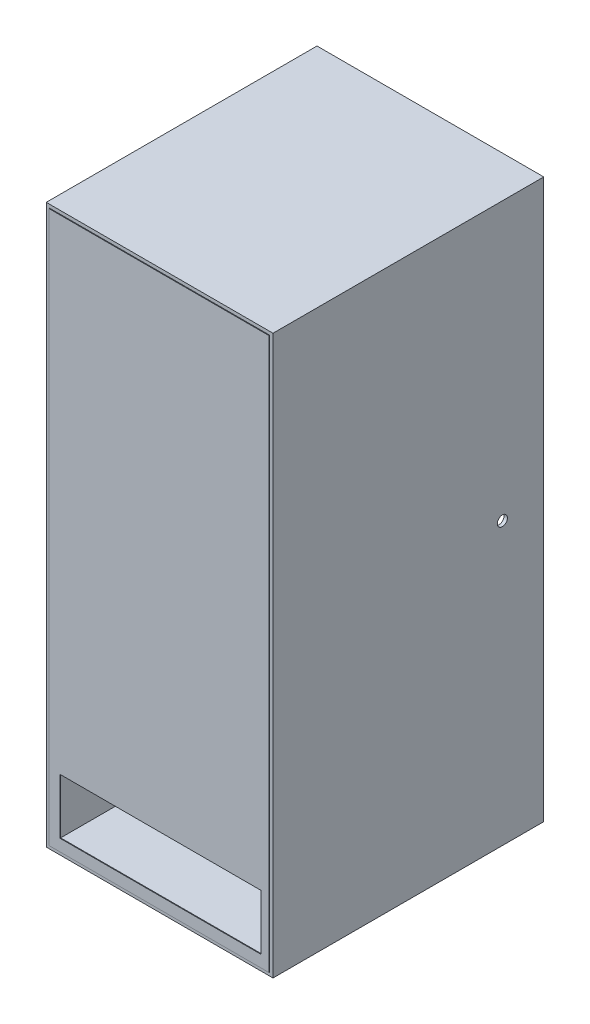
ISO-10303-21;
HEADER;
FILE_DESCRIPTION(('STEP AP214'),'2;1');
FILE_NAME('part.step','',(''),(''),'','','');
FILE_SCHEMA(('AUTOMOTIVE_DESIGN { 1 0 10303 214 1 1 1 1 }'));
ENDSEC;
DATA;
#1=APPLICATION_CONTEXT('core data for automotive mechanical design processes');
#2=APPLICATION_PROTOCOL_DEFINITION('international standard','automotive_design',2000,#1);
#3=PRODUCT_CONTEXT('',#1,'mechanical');
#4=PRODUCT('Part','Part','',(#3));
#5=PRODUCT_RELATED_PRODUCT_CATEGORY('part','',(#4));
#6=PRODUCT_DEFINITION_FORMATION('','',#4);
#7=PRODUCT_DEFINITION_CONTEXT('part definition',#1,'design');
#8=PRODUCT_DEFINITION('design','',#6,#7);
#9=PRODUCT_DEFINITION_SHAPE('','',#8);
#10=(LENGTH_UNIT() NAMED_UNIT(*) SI_UNIT(.MILLI.,.METRE.));
#11=(NAMED_UNIT(*) PLANE_ANGLE_UNIT() SI_UNIT($,.RADIAN.));
#12=(NAMED_UNIT(*) SI_UNIT($,.STERADIAN.) SOLID_ANGLE_UNIT());
#13=UNCERTAINTY_MEASURE_WITH_UNIT(LENGTH_MEASURE(1.E-05),#10,'distance_accuracy_value','');
#14=(GEOMETRIC_REPRESENTATION_CONTEXT(3) GLOBAL_UNCERTAINTY_ASSIGNED_CONTEXT((#13)) GLOBAL_UNIT_ASSIGNED_CONTEXT((#10,
#11,#12)) REPRESENTATION_CONTEXT('',''));
#15=CARTESIAN_POINT('',(0.,0.,0.));
#16=DIRECTION('',(0.,0.,1.));
#17=DIRECTION('',(1.,0.,0.));
#18=AXIS2_PLACEMENT_3D('',#15,#16,#17);
#19=CARTESIAN_POINT('',(-46.9631974674773,119.82,80.2));
#20=DIRECTION('',(1.,0.,0.));
#21=DIRECTION('',(0.,0.,-1.));
#22=AXIS2_PLACEMENT_3D('',#19,#20,#21);
#23=PLANE('',#22);
#24=DIRECTION('',(0.,-1.,0.));
#25=VECTOR('',#24,1.);
#26=CARTESIAN_POINT('',(-46.9631974674773,119.82,80.));
#27=LINE('',#26,#25);
#28=CARTESIAN_POINT('',(-46.9631974674773,119.82,80.));
#29=VERTEX_POINT('',#28);
#30=CARTESIAN_POINT('',(-46.9631974674773,-43.18,80.));
#31=VERTEX_POINT('',#30);
#32=EDGE_CURVE('E322',#29,#31,#27,.T.);
#33=ORIENTED_EDGE('',*,*,#32,.T.);
#34=DIRECTION('',(0.,0.,-1.));
#35=VECTOR('',#34,1.);
#36=CARTESIAN_POINT('',(-46.9631974674773,-43.18,80.2));
#37=LINE('',#36,#35);
#38=CARTESIAN_POINT('',(-46.9631974674773,-43.18,80.2));
#39=VERTEX_POINT('',#38);
#40=EDGE_CURVE('E356',#39,#31,#37,.T.);
#41=ORIENTED_EDGE('',*,*,#40,.F.);
#42=DIRECTION('',(0.,-1.,0.));
#43=VECTOR('',#42,1.);
#44=CARTESIAN_POINT('',(-46.9631974674773,119.82,80.2));
#45=LINE('',#44,#43);
#46=CARTESIAN_POINT('',(-46.9631974674773,119.82,80.2));
#47=VERTEX_POINT('',#46);
#48=EDGE_CURVE('E330',#47,#39,#45,.T.);
#49=ORIENTED_EDGE('',*,*,#48,.F.);
#50=DIRECTION('',(0.,0.,-1.));
#51=VECTOR('',#50,1.);
#52=CARTESIAN_POINT('',(-46.9631974674773,119.82,80.2));
#53=LINE('',#52,#51);
#54=EDGE_CURVE('E340',#47,#29,#53,.T.);
#55=ORIENTED_EDGE('',*,*,#54,.T.);
#56=EDGE_LOOP('',(#33,#41,#49,#55));
#57=FACE_BOUND('',#56,.T.);
#58=ADVANCED_FACE('F91',(#57),#23,.F.);
#59=CARTESIAN_POINT('',(-46.9631974674773,-43.18,80.2));
#60=DIRECTION('',(0.,1.,0.));
#61=DIRECTION('',(0.,0.,1.));
#62=AXIS2_PLACEMENT_3D('',#59,#60,#61);
#63=PLANE('',#62);
#64=DIRECTION('',(1.,0.,0.));
#65=VECTOR('',#64,1.);
#66=CARTESIAN_POINT('',(-46.9631974674773,-43.18,80.));
#67=LINE('',#66,#65);
#68=CARTESIAN_POINT('',(18.0368025325228,-43.18,80.));
#69=VERTEX_POINT('',#68);
#70=EDGE_CURVE('E343',#31,#69,#67,.T.);
#71=ORIENTED_EDGE('',*,*,#70,.T.);
#72=DIRECTION('',(0.,0.,-1.));
#73=VECTOR('',#72,1.);
#74=CARTESIAN_POINT('',(18.0368025325228,-43.18,80.2));
#75=LINE('',#74,#73);
#76=CARTESIAN_POINT('',(18.0368025325228,-43.18,80.2));
#77=VERTEX_POINT('',#76);
#78=EDGE_CURVE('E353',#77,#69,#75,.T.);
#79=ORIENTED_EDGE('',*,*,#78,.F.);
#80=DIRECTION('',(1.,0.,0.));
#81=VECTOR('',#80,1.);
#82=CARTESIAN_POINT('',(-46.9631974674773,-43.18,80.2));
#83=LINE('',#82,#81);
#84=EDGE_CURVE('E333',#39,#77,#83,.T.);
#85=ORIENTED_EDGE('',*,*,#84,.F.);
#86=ORIENTED_EDGE('',*,*,#40,.T.);
#87=EDGE_LOOP('',(#71,#79,#85,#86));
#88=FACE_BOUND('',#87,.T.);
#89=ADVANCED_FACE('F444',(#88),#63,.F.);
#90=CARTESIAN_POINT('',(18.0368025325227,119.82,80.2));
#91=DIRECTION('',(-1.,0.,0.));
#92=DIRECTION('',(0.,-1.,0.));
#93=AXIS2_PLACEMENT_3D('',#90,#91,#92);
#94=PLANE('',#93);
#95=DIRECTION('',(0.,1.,0.));
#96=VECTOR('',#95,1.);
#97=CARTESIAN_POINT('',(18.0368025325227,119.82,80.));
#98=LINE('',#97,#96);
#99=CARTESIAN_POINT('',(18.0368025325227,119.82,80.));
#100=VERTEX_POINT('',#99);
#101=EDGE_CURVE('E345',#69,#100,#98,.T.);
#102=ORIENTED_EDGE('',*,*,#101,.T.);
#103=DIRECTION('',(0.,0.,-1.));
#104=VECTOR('',#103,1.);
#105=CARTESIAN_POINT('',(18.0368025325227,119.82,80.2));
#106=LINE('',#105,#104);
#107=CARTESIAN_POINT('',(18.0368025325227,119.82,80.2));
#108=VERTEX_POINT('',#107);
#109=EDGE_CURVE('E350',#108,#100,#106,.T.);
#110=ORIENTED_EDGE('',*,*,#109,.F.);
#111=DIRECTION('',(0.,1.,0.));
#112=VECTOR('',#111,1.);
#113=CARTESIAN_POINT('',(18.0368025325227,119.82,80.2));
#114=LINE('',#113,#112);
#115=EDGE_CURVE('E336',#77,#108,#114,.T.);
#116=ORIENTED_EDGE('',*,*,#115,.F.);
#117=ORIENTED_EDGE('',*,*,#78,.T.);
#118=EDGE_LOOP('',(#102,#110,#116,#117));
#119=FACE_BOUND('',#118,.T.);
#120=ADVANCED_FACE('F441',(#119),#94,.F.);
#121=CARTESIAN_POINT('',(-46.9631974674773,119.82,80.2));
#122=DIRECTION('',(0.,-1.,0.));
#123=DIRECTION('',(0.,0.,-1.));
#124=AXIS2_PLACEMENT_3D('',#121,#122,#123);
#125=PLANE('',#124);
#126=DIRECTION('',(-1.,0.,0.));
#127=VECTOR('',#126,1.);
#128=CARTESIAN_POINT('',(-46.9631974674773,119.82,80.));
#129=LINE('',#128,#127);
#130=EDGE_CURVE('E334',#100,#29,#129,.T.);
#131=ORIENTED_EDGE('',*,*,#130,.T.);
#132=ORIENTED_EDGE('',*,*,#54,.F.);
#133=DIRECTION('',(-1.,0.,0.));
#134=VECTOR('',#133,1.);
#135=CARTESIAN_POINT('',(-46.9631974674773,119.82,80.2));
#136=LINE('',#135,#134);
#137=EDGE_CURVE('E338',#108,#47,#136,.T.);
#138=ORIENTED_EDGE('',*,*,#137,.F.);
#139=ORIENTED_EDGE('',*,*,#109,.T.);
#140=EDGE_LOOP('',(#131,#132,#138,#139));
#141=FACE_BOUND('',#140,.T.);
#142=ADVANCED_FACE('F437',(#141),#125,.F.);
#143=CARTESIAN_POINT('',(0.,0.,80.2));
#144=DIRECTION('',(0.,0.,1.));
#145=DIRECTION('',(1.,0.,0.));
#146=AXIS2_PLACEMENT_3D('',#143,#144,#145);
#147=PLANE('',#146);
#148=DIRECTION('',(0.,1.,0.));
#149=VECTOR('',#148,1.);
#150=CARTESIAN_POINT('',(15.664300671514,0.,80.2));
#151=LINE('',#150,#149);
#152=CARTESIAN_POINT('',(15.664300671514,-39.6858157417803,80.2));
#153=VERTEX_POINT('',#152);
#154=CARTESIAN_POINT('',(15.664300671514,-23.328040729593,80.2));
#155=VERTEX_POINT('',#154);
#156=EDGE_CURVE('E260',#153,#155,#151,.T.);
#157=ORIENTED_EDGE('',*,*,#156,.F.);
#158=DIRECTION('',(1.,0.,0.));
#159=VECTOR('',#158,1.);
#160=CARTESIAN_POINT('',(0.,-39.6858157417803,80.2));
#161=LINE('',#160,#159);
#162=CARTESIAN_POINT('',(-43.6932915337844,-39.6858157417803,80.2));
#163=VERTEX_POINT('',#162);
#164=EDGE_CURVE('E253',#163,#153,#161,.T.);
#165=ORIENTED_EDGE('',*,*,#164,.F.);
#166=DIRECTION('',(0.,-1.,0.));
#167=VECTOR('',#166,1.);
#168=CARTESIAN_POINT('',(-43.6932915337844,0.,80.2));
#169=LINE('',#168,#167);
#170=CARTESIAN_POINT('',(-43.6932915337844,-23.328040729593,80.2));
#171=VERTEX_POINT('',#170);
#172=EDGE_CURVE('E233',#171,#163,#169,.T.);
#173=ORIENTED_EDGE('',*,*,#172,.F.);
#174=DIRECTION('',(-1.,0.,0.));
#175=VECTOR('',#174,1.);
#176=CARTESIAN_POINT('',(0.,-23.328040729593,80.2));
#177=LINE('',#176,#175);
#178=EDGE_CURVE('E258',#155,#171,#177,.T.);
#179=ORIENTED_EDGE('',*,*,#178,.F.);
#180=EDGE_LOOP('',(#157,#165,#173,#179));
#181=FACE_BOUND('',#180,.T.);
#182=ORIENTED_EDGE('',*,*,#48,.T.);
#183=ORIENTED_EDGE('',*,*,#84,.T.);
#184=ORIENTED_EDGE('',*,*,#115,.T.);
#185=ORIENTED_EDGE('',*,*,#137,.T.);
#186=EDGE_LOOP('',(#182,#183,#184,#185));
#187=FACE_BOUND('',#186,.T.);
#188=ADVANCED_FACE('F426',(#181,#187),#147,.T.);
#189=CARTESIAN_POINT('',(0.,0.,80.));
#190=DIRECTION('',(0.,0.,1.));
#191=DIRECTION('',(1.,0.,0.));
#192=AXIS2_PLACEMENT_3D('',#189,#190,#191);
#193=PLANE('',#192);
#194=DIRECTION('',(-1.,0.,0.));
#195=VECTOR('',#194,1.);
#196=CARTESIAN_POINT('',(0.,-21.919086410198,80.));
#197=LINE('',#196,#195);
#198=CARTESIAN_POINT('',(17.031383519028,-21.919086410198,80.));
#199=VERTEX_POINT('',#198);
#200=CARTESIAN_POINT('',(-45.0828545321867,-21.919086410198,80.));
#201=VERTEX_POINT('',#200);
#202=EDGE_CURVE('E377',#199,#201,#197,.T.);
#203=ORIENTED_EDGE('',*,*,#202,.T.);
#204=DIRECTION('',(0.,-1.,0.));
#205=VECTOR('',#204,1.);
#206=CARTESIAN_POINT('',(-45.0828545321867,0.,80.));
#207=LINE('',#206,#205);
#208=CARTESIAN_POINT('',(-45.0828545321867,-41.0658266501353,80.));
#209=VERTEX_POINT('',#208);
#210=EDGE_CURVE('E380',#201,#209,#207,.T.);
#211=ORIENTED_EDGE('',*,*,#210,.T.);
#212=DIRECTION('',(1.,0.,0.));
#213=VECTOR('',#212,1.);
#214=CARTESIAN_POINT('',(0.,-41.0658266501353,80.));
#215=LINE('',#214,#213);
#216=CARTESIAN_POINT('',(17.031383519028,-41.0658266501353,80.));
#217=VERTEX_POINT('',#216);
#218=EDGE_CURVE('E371',#209,#217,#215,.T.);
#219=ORIENTED_EDGE('',*,*,#218,.T.);
#220=DIRECTION('',(0.,1.,0.));
#221=VECTOR('',#220,1.);
#222=CARTESIAN_POINT('',(17.031383519028,0.,80.));
#223=LINE('',#222,#221);
#224=EDGE_CURVE('E374',#217,#199,#223,.T.);
#225=ORIENTED_EDGE('',*,*,#224,.T.);
#226=EDGE_LOOP('',(#203,#211,#219,#225));
#227=FACE_BOUND('',#226,.T.);
#228=ORIENTED_EDGE('',*,*,#32,.F.);
#229=ORIENTED_EDGE('',*,*,#130,.F.);
#230=ORIENTED_EDGE('',*,*,#101,.F.);
#231=ORIENTED_EDGE('',*,*,#70,.F.);
#232=EDGE_LOOP('',(#228,#229,#230,#231));
#233=FACE_BOUND('',#232,.T.);
#234=ADVANCED_FACE('F423',(#227,#233),#193,.F.);
#235=CARTESIAN_POINT('',(-45.0828545321867,0.,20.2));
#236=DIRECTION('',(-1.,0.,0.));
#237=DIRECTION('',(0.,0.,1.));
#238=AXIS2_PLACEMENT_3D('',#235,#236,#237);
#239=PLANE('',#238);
#240=ORIENTED_EDGE('',*,*,#210,.F.);
#241=DIRECTION('',(0.,0.,1.));
#242=VECTOR('',#241,1.);
#243=CARTESIAN_POINT('',(-45.0828545321867,-21.919086410198,20.2));
#244=LINE('',#243,#242);
#245=CARTESIAN_POINT('',(-45.0828545321867,-21.919086410198,20.2));
#246=VERTEX_POINT('',#245);
#247=EDGE_CURVE('E319',#246,#201,#244,.T.);
#248=ORIENTED_EDGE('',*,*,#247,.F.);
#249=DIRECTION('',(0.,-1.,0.));
#250=VECTOR('',#249,1.);
#251=CARTESIAN_POINT('',(-45.0828545321867,0.,20.2));
#252=LINE('',#251,#250);
#253=CARTESIAN_POINT('',(-45.0828545321867,-41.0658266501353,20.2));
#254=VERTEX_POINT('',#253);
#255=EDGE_CURVE('E297',#246,#254,#252,.T.);
#256=ORIENTED_EDGE('',*,*,#255,.T.);
#257=DIRECTION('',(0.,0.,1.));
#258=VECTOR('',#257,1.);
#259=CARTESIAN_POINT('',(-45.0828545321867,-41.0658266501353,20.2));
#260=LINE('',#259,#258);
#261=EDGE_CURVE('E318',#254,#209,#260,.T.);
#262=ORIENTED_EDGE('',*,*,#261,.T.);
#263=EDGE_LOOP('',(#240,#248,#256,#262));
#264=FACE_BOUND('',#263,.T.);
#265=ADVANCED_FACE('F420',(#264),#239,.T.);
#266=CARTESIAN_POINT('',(0.,-21.919086410198,20.2));
#267=DIRECTION('',(0.,1.,0.));
#268=DIRECTION('',(0.,0.,1.));
#269=AXIS2_PLACEMENT_3D('',#266,#267,#268);
#270=PLANE('',#269);
#271=DIRECTION('',(0.,0.,1.));
#272=VECTOR('',#271,1.);
#273=CARTESIAN_POINT('',(-29.1812228900312,-21.919086410198,20.2));
#274=LINE('',#273,#272);
#275=CARTESIAN_POINT('',(-29.1812228900312,-21.919086410198,20.2));
#276=VERTEX_POINT('',#275);
#277=CARTESIAN_POINT('',(-29.1812228900312,-21.919086410198,76.4792292412722));
#278=VERTEX_POINT('',#277);
#279=EDGE_CURVE('E262',#276,#278,#274,.T.);
#280=ORIENTED_EDGE('',*,*,#279,.F.);
#281=DIRECTION('',(-1.,0.,0.));
#282=VECTOR('',#281,1.);
#283=CARTESIAN_POINT('',(0.,-21.919086410198,20.2));
#284=LINE('',#283,#282);
#285=EDGE_CURVE('E314',#276,#246,#284,.T.);
#286=ORIENTED_EDGE('',*,*,#285,.T.);
#287=ORIENTED_EDGE('',*,*,#247,.T.);
#288=ORIENTED_EDGE('',*,*,#202,.F.);
#289=DIRECTION('',(0.,0.,1.));
#290=VECTOR('',#289,1.);
#291=CARTESIAN_POINT('',(17.031383519028,-21.919086410198,20.2));
#292=LINE('',#291,#290);
#293=CARTESIAN_POINT('',(17.031383519028,-21.919086410198,20.2));
#294=VERTEX_POINT('',#293);
#295=EDGE_CURVE('E323',#294,#199,#292,.T.);
#296=ORIENTED_EDGE('',*,*,#295,.F.);
#297=CARTESIAN_POINT('',(-5.57357946954085,-21.919086410198,20.2));
#298=VERTEX_POINT('',#297);
#299=EDGE_CURVE('E315',#294,#298,#284,.T.);
#300=ORIENTED_EDGE('',*,*,#299,.T.);
#301=DIRECTION('',(0.,0.,-1.));
#302=VECTOR('',#301,1.);
#303=CARTESIAN_POINT('',(-5.57357946954085,-21.919086410198,20.2));
#304=LINE('',#303,#302);
#305=CARTESIAN_POINT('',(-5.57357946954085,-21.919086410198,76.4792292412722));
#306=VERTEX_POINT('',#305);
#307=EDGE_CURVE('E268',#306,#298,#304,.T.);
#308=ORIENTED_EDGE('',*,*,#307,.F.);
#309=DIRECTION('',(1.,0.,0.));
#310=VECTOR('',#309,1.);
#311=CARTESIAN_POINT('',(-29.1812228900312,-21.919086410198,76.4792292412722));
#312=LINE('',#311,#310);
#313=EDGE_CURVE('E265',#278,#306,#312,.T.);
#314=ORIENTED_EDGE('',*,*,#313,.F.);
#315=EDGE_LOOP('',(#280,#286,#287,#288,#296,#300,#308,#314));
#316=FACE_BOUND('',#315,.T.);
#317=ADVANCED_FACE('F411',(#316),#270,.T.);
#318=CARTESIAN_POINT('',(17.031383519028,0.,20.2));
#319=DIRECTION('',(1.,0.,0.));
#320=DIRECTION('',(0.,0.,-1.));
#321=AXIS2_PLACEMENT_3D('',#318,#319,#320);
#322=PLANE('',#321);
#323=ORIENTED_EDGE('',*,*,#224,.F.);
#324=DIRECTION('',(0.,0.,1.));
#325=VECTOR('',#324,1.);
#326=CARTESIAN_POINT('',(17.031383519028,-41.0658266501353,20.2));
#327=LINE('',#326,#325);
#328=CARTESIAN_POINT('',(17.031383519028,-41.0658266501353,20.2));
#329=VERTEX_POINT('',#328);
#330=EDGE_CURVE('E326',#329,#217,#327,.T.);
#331=ORIENTED_EDGE('',*,*,#330,.F.);
#332=DIRECTION('',(0.,1.,0.));
#333=VECTOR('',#332,1.);
#334=CARTESIAN_POINT('',(17.031383519028,0.,20.2));
#335=LINE('',#334,#333);
#336=EDGE_CURVE('E311',#329,#294,#335,.T.);
#337=ORIENTED_EDGE('',*,*,#336,.T.);
#338=ORIENTED_EDGE('',*,*,#295,.T.);
#339=EDGE_LOOP('',(#323,#331,#337,#338));
#340=FACE_BOUND('',#339,.T.);
#341=ADVANCED_FACE('F415',(#340),#322,.T.);
#342=CARTESIAN_POINT('',(0.,-41.0658266501353,20.2));
#343=DIRECTION('',(0.,-1.,0.));
#344=DIRECTION('',(0.,0.,-1.));
#345=AXIS2_PLACEMENT_3D('',#342,#343,#344);
#346=PLANE('',#345);
#347=ORIENTED_EDGE('',*,*,#218,.F.);
#348=ORIENTED_EDGE('',*,*,#261,.F.);
#349=DIRECTION('',(1.,0.,0.));
#350=VECTOR('',#349,1.);
#351=CARTESIAN_POINT('',(0.,-41.0658266501353,20.2));
#352=LINE('',#351,#350);
#353=EDGE_CURVE('E308',#254,#329,#352,.T.);
#354=ORIENTED_EDGE('',*,*,#353,.T.);
#355=ORIENTED_EDGE('',*,*,#330,.T.);
#356=EDGE_LOOP('',(#347,#348,#354,#355));
#357=FACE_BOUND('',#356,.T.);
#358=ADVANCED_FACE('F418',(#357),#346,.T.);
#359=CARTESIAN_POINT('',(-44.0828545321867,-40.0658266501353,20.2));
#360=DIRECTION('',(-1.,0.,0.));
#361=DIRECTION('',(0.,0.,1.));
#362=AXIS2_PLACEMENT_3D('',#359,#360,#361);
#363=PLANE('',#362);
#364=DIRECTION('',(0.,0.,1.));
#365=VECTOR('',#364,1.);
#366=CARTESIAN_POINT('',(-44.0828545321867,-22.919086410198,20.2));
#367=LINE('',#366,#365);
#368=CARTESIAN_POINT('',(-44.0828545321867,-22.919086410198,20.2));
#369=VERTEX_POINT('',#368);
#370=CARTESIAN_POINT('',(-44.0828545321867,-22.919086410198,80.));
#371=VERTEX_POINT('',#370);
#372=EDGE_CURVE('E294',#369,#371,#367,.T.);
#373=ORIENTED_EDGE('',*,*,#372,.T.);
#374=DIRECTION('',(0.,-1.,0.));
#375=VECTOR('',#374,1.);
#376=CARTESIAN_POINT('',(-44.0828545321867,0.,80.));
#377=LINE('',#376,#375);
#378=CARTESIAN_POINT('',(-44.0828545321867,-40.0658266501353,80.));
#379=VERTEX_POINT('',#378);
#380=EDGE_CURVE('E368',#371,#379,#377,.T.);
#381=ORIENTED_EDGE('',*,*,#380,.T.);
#382=DIRECTION('',(0.,0.,1.));
#383=VECTOR('',#382,1.);
#384=CARTESIAN_POINT('',(-44.0828545321867,-40.0658266501353,20.2));
#385=LINE('',#384,#383);
#386=CARTESIAN_POINT('',(-44.0828545321867,-40.0658266501353,20.2));
#387=VERTEX_POINT('',#386);
#388=EDGE_CURVE('E293',#387,#379,#385,.T.);
#389=ORIENTED_EDGE('',*,*,#388,.F.);
#390=DIRECTION('',(0.,-1.,0.));
#391=VECTOR('',#390,1.);
#392=CARTESIAN_POINT('',(-44.0828545321867,-40.0658266501353,20.2));
#393=LINE('',#392,#391);
#394=EDGE_CURVE('E280',#369,#387,#393,.T.);
#395=ORIENTED_EDGE('',*,*,#394,.F.);
#396=EDGE_LOOP('',(#373,#381,#389,#395));
#397=FACE_BOUND('',#396,.T.);
#398=ADVANCED_FACE('F398',(#397),#363,.F.);
#399=CARTESIAN_POINT('',(-44.0828545321867,-22.919086410198,20.2));
#400=DIRECTION('',(0.,1.,0.));
#401=DIRECTION('',(0.,0.,1.));
#402=AXIS2_PLACEMENT_3D('',#399,#400,#401);
#403=PLANE('',#402);
#404=DIRECTION('',(-1.,0.,0.));
#405=VECTOR('',#404,1.);
#406=CARTESIAN_POINT('',(-44.0828545321867,-22.919086410198,20.2));
#407=LINE('',#406,#405);
#408=CARTESIAN_POINT('',(-29.1812228900312,-22.919086410198,20.2));
#409=VERTEX_POINT('',#408);
#410=EDGE_CURVE('E289',#409,#369,#407,.T.);
#411=ORIENTED_EDGE('',*,*,#410,.F.);
#412=DIRECTION('',(0.,0.,1.));
#413=VECTOR('',#412,1.);
#414=CARTESIAN_POINT('',(-29.1812228900312,-22.919086410198,20.2));
#415=LINE('',#414,#413);
#416=CARTESIAN_POINT('',(-29.1812228900312,-22.919086410198,76.4792292412722));
#417=VERTEX_POINT('',#416);
#418=EDGE_CURVE('E277',#409,#417,#415,.T.);
#419=ORIENTED_EDGE('',*,*,#418,.T.);
#420=DIRECTION('',(1.,0.,0.));
#421=VECTOR('',#420,1.);
#422=CARTESIAN_POINT('',(-44.0828545321867,-22.919086410198,76.4792292412722));
#423=LINE('',#422,#421);
#424=CARTESIAN_POINT('',(-5.57357946954085,-22.919086410198,76.4792292412722));
#425=VERTEX_POINT('',#424);
#426=EDGE_CURVE('E13',#417,#425,#423,.T.);
#427=ORIENTED_EDGE('',*,*,#426,.T.);
#428=DIRECTION('',(0.,0.,-1.));
#429=VECTOR('',#428,1.);
#430=CARTESIAN_POINT('',(-5.57357946954085,-22.919086410198,20.2));
#431=LINE('',#430,#429);
#432=CARTESIAN_POINT('',(-5.57357946954085,-22.919086410198,20.2));
#433=VERTEX_POINT('',#432);
#434=EDGE_CURVE('E273',#425,#433,#431,.T.);
#435=ORIENTED_EDGE('',*,*,#434,.T.);
#436=CARTESIAN_POINT('',(16.031383519028,-22.919086410198,20.2));
#437=VERTEX_POINT('',#436);
#438=EDGE_CURVE('E290',#437,#433,#407,.T.);
#439=ORIENTED_EDGE('',*,*,#438,.F.);
#440=DIRECTION('',(0.,0.,1.));
#441=VECTOR('',#440,1.);
#442=CARTESIAN_POINT('',(16.031383519028,-22.919086410198,20.2));
#443=LINE('',#442,#441);
#444=CARTESIAN_POINT('',(16.031383519028,-22.919086410198,80.));
#445=VERTEX_POINT('',#444);
#446=EDGE_CURVE('E298',#437,#445,#443,.T.);
#447=ORIENTED_EDGE('',*,*,#446,.T.);
#448=DIRECTION('',(-1.,0.,0.));
#449=VECTOR('',#448,1.);
#450=CARTESIAN_POINT('',(0.,-22.919086410198,80.));
#451=LINE('',#450,#449);
#452=EDGE_CURVE('E365',#445,#371,#451,.T.);
#453=ORIENTED_EDGE('',*,*,#452,.T.);
#454=ORIENTED_EDGE('',*,*,#372,.F.);
#455=EDGE_LOOP('',(#411,#419,#427,#435,#439,#447,#453,#454));
#456=FACE_BOUND('',#455,.T.);
#457=ADVANCED_FACE('F395',(#456),#403,.F.);
#458=CARTESIAN_POINT('',(16.031383519028,-40.0658266501353,20.2));
#459=DIRECTION('',(1.,0.,0.));
#460=DIRECTION('',(0.,0.,-1.));
#461=AXIS2_PLACEMENT_3D('',#458,#459,#460);
#462=PLANE('',#461);
#463=DIRECTION('',(0.,0.,1.));
#464=VECTOR('',#463,1.);
#465=CARTESIAN_POINT('',(16.031383519028,-40.0658266501353,20.2));
#466=LINE('',#465,#464);
#467=CARTESIAN_POINT('',(16.031383519028,-40.0658266501353,20.2));
#468=VERTEX_POINT('',#467);
#469=CARTESIAN_POINT('',(16.031383519028,-40.0658266501353,80.));
#470=VERTEX_POINT('',#469);
#471=EDGE_CURVE('E301',#468,#470,#466,.T.);
#472=ORIENTED_EDGE('',*,*,#471,.T.);
#473=DIRECTION('',(0.,1.,0.));
#474=VECTOR('',#473,1.);
#475=CARTESIAN_POINT('',(16.031383519028,0.,80.));
#476=LINE('',#475,#474);
#477=EDGE_CURVE('E362',#470,#445,#476,.T.);
#478=ORIENTED_EDGE('',*,*,#477,.T.);
#479=ORIENTED_EDGE('',*,*,#446,.F.);
#480=DIRECTION('',(0.,1.,0.));
#481=VECTOR('',#480,1.);
#482=CARTESIAN_POINT('',(16.031383519028,-40.0658266501353,20.2));
#483=LINE('',#482,#481);
#484=EDGE_CURVE('E286',#468,#437,#483,.T.);
#485=ORIENTED_EDGE('',*,*,#484,.F.);
#486=EDGE_LOOP('',(#472,#478,#479,#485));
#487=FACE_BOUND('',#486,.T.);
#488=ADVANCED_FACE('F404',(#487),#462,.F.);
#489=CARTESIAN_POINT('',(-44.0828545321867,-40.0658266501353,20.2));
#490=DIRECTION('',(0.,-1.,0.));
#491=DIRECTION('',(0.,0.,-1.));
#492=AXIS2_PLACEMENT_3D('',#489,#490,#491);
#493=PLANE('',#492);
#494=ORIENTED_EDGE('',*,*,#388,.T.);
#495=DIRECTION('',(1.,0.,0.));
#496=VECTOR('',#495,1.);
#497=CARTESIAN_POINT('',(0.,-40.0658266501353,80.));
#498=LINE('',#497,#496);
#499=EDGE_CURVE('E359',#379,#470,#498,.T.);
#500=ORIENTED_EDGE('',*,*,#499,.T.);
#501=ORIENTED_EDGE('',*,*,#471,.F.);
#502=DIRECTION('',(1.,0.,0.));
#503=VECTOR('',#502,1.);
#504=CARTESIAN_POINT('',(-44.0828545321867,-40.0658266501353,20.2));
#505=LINE('',#504,#503);
#506=EDGE_CURVE('E283',#387,#468,#505,.T.);
#507=ORIENTED_EDGE('',*,*,#506,.F.);
#508=EDGE_LOOP('',(#494,#500,#501,#507));
#509=FACE_BOUND('',#508,.T.);
#510=ADVANCED_FACE('F402',(#509),#493,.F.);
#511=CARTESIAN_POINT('',(0.,0.,20.2));
#512=DIRECTION('',(0.,0.,1.));
#513=DIRECTION('',(1.,0.,0.));
#514=AXIS2_PLACEMENT_3D('',#511,#512,#513);
#515=PLANE('',#514);
#516=ORIENTED_EDGE('',*,*,#285,.F.);
#517=DIRECTION('',(0.,-1.,0.));
#518=VECTOR('',#517,1.);
#519=CARTESIAN_POINT('',(-29.1812228900312,0.,20.2));
#520=LINE('',#519,#518);
#521=EDGE_CURVE('E98',#276,#409,#520,.T.);
#522=ORIENTED_EDGE('',*,*,#521,.T.);
#523=ORIENTED_EDGE('',*,*,#410,.T.);
#524=ORIENTED_EDGE('',*,*,#394,.T.);
#525=ORIENTED_EDGE('',*,*,#506,.T.);
#526=ORIENTED_EDGE('',*,*,#484,.T.);
#527=ORIENTED_EDGE('',*,*,#438,.T.);
#528=DIRECTION('',(0.,1.,0.));
#529=VECTOR('',#528,1.);
#530=CARTESIAN_POINT('',(-5.57357946954085,0.,20.2));
#531=LINE('',#530,#529);
#532=EDGE_CURVE('E383',#433,#298,#531,.T.);
#533=ORIENTED_EDGE('',*,*,#532,.T.);
#534=ORIENTED_EDGE('',*,*,#299,.F.);
#535=ORIENTED_EDGE('',*,*,#336,.F.);
#536=ORIENTED_EDGE('',*,*,#353,.F.);
#537=ORIENTED_EDGE('',*,*,#255,.F.);
#538=EDGE_LOOP('',(#516,#522,#523,#524,#525,#526,#527,#533,#534,#535,#536,#537));
#539=FACE_BOUND('',#538,.T.);
#540=ADVANCED_FACE('F389',(#539),#515,.F.);
#541=DIRECTION('',(-1.,0.,0.));
#542=VECTOR('',#541,1.);
#543=CARTESIAN_POINT('',(15.664300671514,-39.6858157417803,80.));
#544=LINE('',#543,#542);
#545=CARTESIAN_POINT('',(15.664300671514,-39.6858157417803,80.));
#546=VERTEX_POINT('',#545);
#547=CARTESIAN_POINT('',(-43.6932915337844,-39.6858157417803,80.));
#548=VERTEX_POINT('',#547);
#549=EDGE_CURVE('E239',#546,#548,#544,.T.);
#550=ORIENTED_EDGE('',*,*,#549,.F.);
#551=DIRECTION('',(0.,-1.,0.));
#552=VECTOR('',#551,1.);
#553=CARTESIAN_POINT('',(15.664300671514,-23.328040729593,80.));
#554=LINE('',#553,#552);
#555=CARTESIAN_POINT('',(15.664300671514,-23.328040729593,80.));
#556=VERTEX_POINT('',#555);
#557=EDGE_CURVE('E113',#556,#546,#554,.T.);
#558=ORIENTED_EDGE('',*,*,#557,.F.);
#559=DIRECTION('',(1.,0.,0.));
#560=VECTOR('',#559,1.);
#561=CARTESIAN_POINT('',(15.664300671514,-23.328040729593,80.));
#562=LINE('',#561,#560);
#563=CARTESIAN_POINT('',(-43.6932915337844,-23.328040729593,80.));
#564=VERTEX_POINT('',#563);
#565=EDGE_CURVE('E246',#564,#556,#562,.T.);
#566=ORIENTED_EDGE('',*,*,#565,.F.);
#567=DIRECTION('',(0.,1.,0.));
#568=VECTOR('',#567,1.);
#569=CARTESIAN_POINT('',(-43.6932915337844,-23.328040729593,80.));
#570=LINE('',#569,#568);
#571=EDGE_CURVE('E230',#548,#564,#570,.T.);
#572=ORIENTED_EDGE('',*,*,#571,.F.);
#573=EDGE_LOOP('',(#550,#558,#566,#572));
#574=FACE_BOUND('',#573,.T.);
#575=ORIENTED_EDGE('',*,*,#380,.F.);
#576=ORIENTED_EDGE('',*,*,#452,.F.);
#577=ORIENTED_EDGE('',*,*,#477,.F.);
#578=ORIENTED_EDGE('',*,*,#499,.F.);
#579=EDGE_LOOP('',(#575,#576,#577,#578));
#580=FACE_BOUND('',#579,.T.);
#581=ADVANCED_FACE('F243',(#574,#580),#193,.F.);
#582=CARTESIAN_POINT('',(-29.1812228900312,-31.919086410198,76.4792292412722));
#583=DIRECTION('',(0.,0.,1.));
#584=DIRECTION('',(1.,0.,0.));
#585=AXIS2_PLACEMENT_3D('',#582,#583,#584);
#586=PLANE('',#585);
#587=DIRECTION('',(0.,1.,0.));
#588=VECTOR('',#587,1.);
#589=CARTESIAN_POINT('',(-29.1812228900312,-31.919086410198,76.4792292412722));
#590=LINE('',#589,#588);
#591=EDGE_CURVE('E270',#417,#278,#590,.T.);
#592=ORIENTED_EDGE('',*,*,#591,.T.);
#593=ORIENTED_EDGE('',*,*,#313,.T.);
#594=DIRECTION('',(0.,1.,0.));
#595=VECTOR('',#594,1.);
#596=CARTESIAN_POINT('',(-5.57357946954085,-31.919086410198,76.4792292412722));
#597=LINE('',#596,#595);
#598=EDGE_CURVE('E271',#425,#306,#597,.T.);
#599=ORIENTED_EDGE('',*,*,#598,.F.);
#600=ORIENTED_EDGE('',*,*,#426,.F.);
#601=EDGE_LOOP('',(#592,#593,#599,#600));
#602=FACE_BOUND('',#601,.T.);
#603=ADVANCED_FACE('F555',(#602),#586,.F.);
#604=CARTESIAN_POINT('',(-29.1812228900312,-31.919086410198,20.2));
#605=DIRECTION('',(-1.,0.,0.));
#606=DIRECTION('',(0.,0.,1.));
#607=AXIS2_PLACEMENT_3D('',#604,#605,#606);
#608=PLANE('',#607);
#609=ORIENTED_EDGE('',*,*,#521,.F.);
#610=ORIENTED_EDGE('',*,*,#279,.T.);
#611=ORIENTED_EDGE('',*,*,#591,.F.);
#612=ORIENTED_EDGE('',*,*,#418,.F.);
#613=EDGE_LOOP('',(#609,#610,#611,#612));
#614=FACE_BOUND('',#613,.T.);
#615=ADVANCED_FACE('F559',(#614),#608,.F.);
#616=CARTESIAN_POINT('',(-5.57357946954085,-31.919086410198,20.2));
#617=DIRECTION('',(1.,0.,0.));
#618=DIRECTION('',(0.,0.,-1.));
#619=AXIS2_PLACEMENT_3D('',#616,#617,#618);
#620=PLANE('',#619);
#621=ORIENTED_EDGE('',*,*,#598,.T.);
#622=ORIENTED_EDGE('',*,*,#307,.T.);
#623=ORIENTED_EDGE('',*,*,#532,.F.);
#624=ORIENTED_EDGE('',*,*,#434,.F.);
#625=EDGE_LOOP('',(#621,#622,#623,#624));
#626=FACE_BOUND('',#625,.T.);
#627=ADVANCED_FACE('F569',(#626),#620,.F.);
#628=CARTESIAN_POINT('',(15.664300671514,-23.328040729593,90.));
#629=DIRECTION('',(1.,0.,0.));
#630=DIRECTION('',(0.,0.,-1.));
#631=AXIS2_PLACEMENT_3D('',#628,#629,#630);
#632=PLANE('',#631);
#633=ORIENTED_EDGE('',*,*,#156,.T.);
#634=DIRECTION('',(0.,0.,-1.));
#635=VECTOR('',#634,1.);
#636=CARTESIAN_POINT('',(15.664300671514,-23.328040729593,90.));
#637=LINE('',#636,#635);
#638=EDGE_CURVE('E251',#155,#556,#637,.T.);
#639=ORIENTED_EDGE('',*,*,#638,.T.);
#640=ORIENTED_EDGE('',*,*,#557,.T.);
#641=DIRECTION('',(0.,0.,-1.));
#642=VECTOR('',#641,1.);
#643=CARTESIAN_POINT('',(15.664300671514,-39.6858157417803,90.));
#644=LINE('',#643,#642);
#645=EDGE_CURVE('E236',#153,#546,#644,.T.);
#646=ORIENTED_EDGE('',*,*,#645,.F.);
#647=EDGE_LOOP('',(#633,#639,#640,#646));
#648=FACE_BOUND('',#647,.T.);
#649=ADVANCED_FACE('F577',(#648),#632,.F.);
#650=CARTESIAN_POINT('',(15.664300671514,-23.328040729593,90.));
#651=DIRECTION('',(0.,1.,0.));
#652=DIRECTION('',(0.,0.,1.));
#653=AXIS2_PLACEMENT_3D('',#650,#651,#652);
#654=PLANE('',#653);
#655=ORIENTED_EDGE('',*,*,#178,.T.);
#656=DIRECTION('',(0.,0.,-1.));
#657=VECTOR('',#656,1.);
#658=CARTESIAN_POINT('',(-43.6932915337844,-23.328040729593,90.));
#659=LINE('',#658,#657);
#660=EDGE_CURVE('E235',#171,#564,#659,.T.);
#661=ORIENTED_EDGE('',*,*,#660,.T.);
#662=ORIENTED_EDGE('',*,*,#565,.T.);
#663=ORIENTED_EDGE('',*,*,#638,.F.);
#664=EDGE_LOOP('',(#655,#661,#662,#663));
#665=FACE_BOUND('',#664,.T.);
#666=ADVANCED_FACE('F595',(#665),#654,.F.);
#667=CARTESIAN_POINT('',(-43.6932915337844,-23.328040729593,90.));
#668=DIRECTION('',(-1.,0.,0.));
#669=DIRECTION('',(0.,0.,1.));
#670=AXIS2_PLACEMENT_3D('',#667,#668,#669);
#671=PLANE('',#670);
#672=ORIENTED_EDGE('',*,*,#172,.T.);
#673=DIRECTION('',(0.,0.,-1.));
#674=VECTOR('',#673,1.);
#675=CARTESIAN_POINT('',(-43.6932915337844,-39.6858157417803,90.));
#676=LINE('',#675,#674);
#677=EDGE_CURVE('E105',#163,#548,#676,.T.);
#678=ORIENTED_EDGE('',*,*,#677,.T.);
#679=ORIENTED_EDGE('',*,*,#571,.T.);
#680=ORIENTED_EDGE('',*,*,#660,.F.);
#681=EDGE_LOOP('',(#672,#678,#679,#680));
#682=FACE_BOUND('',#681,.T.);
#683=ADVANCED_FACE('F227',(#682),#671,.F.);
#684=CARTESIAN_POINT('',(15.664300671514,-39.6858157417803,90.));
#685=DIRECTION('',(0.,-1.,0.));
#686=DIRECTION('',(0.,0.,-1.));
#687=AXIS2_PLACEMENT_3D('',#684,#685,#686);
#688=PLANE('',#687);
#689=ORIENTED_EDGE('',*,*,#164,.T.);
#690=ORIENTED_EDGE('',*,*,#645,.T.);
#691=ORIENTED_EDGE('',*,*,#549,.T.);
#692=ORIENTED_EDGE('',*,*,#677,.F.);
#693=EDGE_LOOP('',(#689,#690,#691,#692));
#694=FACE_BOUND('',#693,.T.);
#695=ADVANCED_FACE('F240',(#694),#688,.F.);
#696=CLOSED_SHELL('',(#58,#89,#120,#142,#188,#234,#265,#317,#341,#358,#398,#457,#488,#510,#540,
#581,#603,#615,#627,#649,#666,#683,#695));
#697=MANIFOLD_SOLID_BREP('B2',#696);
#698=CARTESIAN_POINT('',(0.,0.,80.));
#699=DIRECTION('',(0.,0.,1.));
#700=DIRECTION('',(1.,0.,0.));
#701=AXIS2_PLACEMENT_3D('',#698,#699,#700);
#702=PLANE('',#701);
#703=DIRECTION('',(0.,-1.,0.));
#704=VECTOR('',#703,1.);
#705=CARTESIAN_POINT('',(-47.9631974674773,119.82,80.));
#706=LINE('',#705,#704);
#707=CARTESIAN_POINT('',(-47.9631974674773,120.82,80.));
#708=VERTEX_POINT('',#707);
#709=CARTESIAN_POINT('',(-47.9631974674772,-44.18,80.));
#710=VERTEX_POINT('',#709);
#711=EDGE_CURVE('E744',#708,#710,#706,.T.);
#712=ORIENTED_EDGE('',*,*,#711,.T.);
#713=DIRECTION('',(1.,0.,0.));
#714=VECTOR('',#713,1.);
#715=CARTESIAN_POINT('',(-46.9631974674772,-44.18,80.));
#716=LINE('',#715,#714);
#717=CARTESIAN_POINT('',(19.0368025325228,-44.18,80.));
#718=VERTEX_POINT('',#717);
#719=EDGE_CURVE('E747',#710,#718,#716,.T.);
#720=ORIENTED_EDGE('',*,*,#719,.T.);
#721=DIRECTION('',(0.,1.,0.));
#722=VECTOR('',#721,1.);
#723=CARTESIAN_POINT('',(19.0368025325227,119.82,80.));
#724=LINE('',#723,#722);
#725=CARTESIAN_POINT('',(19.0368025325227,120.82,80.));
#726=VERTEX_POINT('',#725);
#727=EDGE_CURVE('E750',#718,#726,#724,.T.);
#728=ORIENTED_EDGE('',*,*,#727,.T.);
#729=DIRECTION('',(-1.,0.,0.));
#730=VECTOR('',#729,1.);
#731=CARTESIAN_POINT('',(-46.9631974674773,120.82,80.));
#732=LINE('',#731,#730);
#733=EDGE_CURVE('E752',#726,#708,#732,.T.);
#734=ORIENTED_EDGE('',*,*,#733,.T.);
#735=EDGE_LOOP('',(#712,#720,#728,#734));
#736=FACE_BOUND('',#735,.T.);
#737=DIRECTION('',(1.,0.,0.));
#738=VECTOR('',#737,1.);
#739=CARTESIAN_POINT('',(-46.9631974674772,-43.18,80.));
#740=LINE('',#739,#738);
#741=CARTESIAN_POINT('',(-46.9631974674772,-43.18,80.));
#742=VERTEX_POINT('',#741);
#743=CARTESIAN_POINT('',(18.0368025325228,-43.18,80.));
#744=VERTEX_POINT('',#743);
#745=EDGE_CURVE('E715',#742,#744,#740,.T.);
#746=ORIENTED_EDGE('',*,*,#745,.F.);
#747=DIRECTION('',(0.,-1.,0.));
#748=VECTOR('',#747,1.);
#749=CARTESIAN_POINT('',(-46.9631974674773,119.82,80.));
#750=LINE('',#749,#748);
#751=CARTESIAN_POINT('',(-46.9631974674773,119.82,80.));
#752=VERTEX_POINT('',#751);
#753=EDGE_CURVE('E707',#752,#742,#750,.T.);
#754=ORIENTED_EDGE('',*,*,#753,.F.);
#755=DIRECTION('',(-1.,0.,0.));
#756=VECTOR('',#755,1.);
#757=CARTESIAN_POINT('',(-46.9631974674773,119.82,80.));
#758=LINE('',#757,#756);
#759=CARTESIAN_POINT('',(18.0368025325227,119.82,80.));
#760=VERTEX_POINT('',#759);
#761=EDGE_CURVE('E729',#760,#752,#758,.T.);
#762=ORIENTED_EDGE('',*,*,#761,.F.);
#763=DIRECTION('',(0.,1.,0.));
#764=VECTOR('',#763,1.);
#765=CARTESIAN_POINT('',(18.0368025325227,119.82,80.));
#766=LINE('',#765,#764);
#767=EDGE_CURVE('E727',#744,#760,#766,.T.);
#768=ORIENTED_EDGE('',*,*,#767,.F.);
#769=EDGE_LOOP('',(#746,#754,#762,#768));
#770=FACE_BOUND('',#769,.T.);
#771=ADVANCED_FACE('F641',(#736,#770),#702,.T.);
#772=CARTESIAN_POINT('',(0.,0.,0.));
#773=DIRECTION('',(0.,0.,1.));
#774=DIRECTION('',(1.,0.,0.));
#775=AXIS2_PLACEMENT_3D('',#772,#773,#774);
#776=PLANE('',#775);
#777=DIRECTION('',(0.,-1.,0.));
#778=VECTOR('',#777,1.);
#779=CARTESIAN_POINT('',(-47.9631974674773,119.82,0.));
#780=LINE('',#779,#778);
#781=CARTESIAN_POINT('',(-47.9631974674773,120.82,0.));
#782=VERTEX_POINT('',#781);
#783=CARTESIAN_POINT('',(-47.9631974674772,-44.18,0.));
#784=VERTEX_POINT('',#783);
#785=EDGE_CURVE('E723',#782,#784,#780,.T.);
#786=ORIENTED_EDGE('',*,*,#785,.F.);
#787=DIRECTION('',(-1.,0.,0.));
#788=VECTOR('',#787,1.);
#789=CARTESIAN_POINT('',(-46.9631974674773,120.82,0.));
#790=LINE('',#789,#788);
#791=CARTESIAN_POINT('',(19.0368025325227,120.82,0.));
#792=VERTEX_POINT('',#791);
#793=EDGE_CURVE('E748',#792,#782,#790,.T.);
#794=ORIENTED_EDGE('',*,*,#793,.F.);
#795=DIRECTION('',(0.,1.,0.));
#796=VECTOR('',#795,1.);
#797=CARTESIAN_POINT('',(19.0368025325227,119.82,0.));
#798=LINE('',#797,#796);
#799=CARTESIAN_POINT('',(19.0368025325228,-44.18,0.));
#800=VERTEX_POINT('',#799);
#801=EDGE_CURVE('E759',#800,#792,#798,.T.);
#802=ORIENTED_EDGE('',*,*,#801,.F.);
#803=DIRECTION('',(1.,0.,0.));
#804=VECTOR('',#803,1.);
#805=CARTESIAN_POINT('',(-46.9631974674772,-44.18,0.));
#806=LINE('',#805,#804);
#807=EDGE_CURVE('E757',#784,#800,#806,.T.);
#808=ORIENTED_EDGE('',*,*,#807,.F.);
#809=EDGE_LOOP('',(#786,#794,#802,#808));
#810=FACE_BOUND('',#809,.T.);
#811=DIRECTION('',(0.,-1.,0.));
#812=VECTOR('',#811,1.);
#813=CARTESIAN_POINT('',(-46.9631974674773,119.82,0.));
#814=LINE('',#813,#812);
#815=CARTESIAN_POINT('',(-46.9631974674773,119.82,0.));
#816=VERTEX_POINT('',#815);
#817=CARTESIAN_POINT('',(-46.9631974674772,-43.18,0.));
#818=VERTEX_POINT('',#817);
#819=EDGE_CURVE('E665',#816,#818,#814,.T.);
#820=ORIENTED_EDGE('',*,*,#819,.T.);
#821=DIRECTION('',(1.,0.,0.));
#822=VECTOR('',#821,1.);
#823=CARTESIAN_POINT('',(-46.9631974674772,-43.18,0.));
#824=LINE('',#823,#822);
#825=CARTESIAN_POINT('',(18.0368025325228,-43.18,0.));
#826=VERTEX_POINT('',#825);
#827=EDGE_CURVE('E722',#818,#826,#824,.T.);
#828=ORIENTED_EDGE('',*,*,#827,.T.);
#829=DIRECTION('',(0.,1.,0.));
#830=VECTOR('',#829,1.);
#831=CARTESIAN_POINT('',(18.0368025325227,119.82,0.));
#832=LINE('',#831,#830);
#833=CARTESIAN_POINT('',(18.0368025325227,119.82,0.));
#834=VERTEX_POINT('',#833);
#835=EDGE_CURVE('E736',#826,#834,#832,.T.);
#836=ORIENTED_EDGE('',*,*,#835,.T.);
#837=DIRECTION('',(-1.,0.,0.));
#838=VECTOR('',#837,1.);
#839=CARTESIAN_POINT('',(-46.9631974674773,119.82,0.));
#840=LINE('',#839,#838);
#841=EDGE_CURVE('E716',#834,#816,#840,.T.);
#842=ORIENTED_EDGE('',*,*,#841,.T.);
#843=EDGE_LOOP('',(#820,#828,#836,#842));
#844=FACE_BOUND('',#843,.T.);
#845=ADVANCED_FACE('F778',(#810,#844),#776,.F.);
#846=CARTESIAN_POINT('',(-47.9631974674773,119.82,80.));
#847=DIRECTION('',(1.,0.,0.));
#848=DIRECTION('',(0.,1.,0.));
#849=AXIS2_PLACEMENT_3D('',#846,#847,#848);
#850=PLANE('',#849);
#851=ORIENTED_EDGE('',*,*,#785,.T.);
#852=DIRECTION('',(0.,0.,-1.));
#853=VECTOR('',#852,1.);
#854=CARTESIAN_POINT('',(-47.9631974674772,-44.18,80.));
#855=LINE('',#854,#853);
#856=EDGE_CURVE('E89',#710,#784,#855,.T.);
#857=ORIENTED_EDGE('',*,*,#856,.F.);
#858=ORIENTED_EDGE('',*,*,#711,.F.);
#859=DIRECTION('',(0.,0.,-1.));
#860=VECTOR('',#859,1.);
#861=CARTESIAN_POINT('',(-47.9631974674773,120.82,80.));
#862=LINE('',#861,#860);
#863=EDGE_CURVE('E754',#708,#782,#862,.T.);
#864=ORIENTED_EDGE('',*,*,#863,.T.);
#865=EDGE_LOOP('',(#851,#857,#858,#864));
#866=FACE_BOUND('',#865,.T.);
#867=ADVANCED_FACE('F643',(#866),#850,.F.);
#868=CARTESIAN_POINT('',(-46.9631974674772,-44.18,80.));
#869=DIRECTION('',(0.,1.,0.));
#870=DIRECTION('',(0.,0.,1.));
#871=AXIS2_PLACEMENT_3D('',#868,#869,#870);
#872=PLANE('',#871);
#873=ORIENTED_EDGE('',*,*,#807,.T.);
#874=DIRECTION('',(0.,0.,-1.));
#875=VECTOR('',#874,1.);
#876=CARTESIAN_POINT('',(19.0368025325228,-44.18,80.));
#877=LINE('',#876,#875);
#878=EDGE_CURVE('E650',#718,#800,#877,.T.);
#879=ORIENTED_EDGE('',*,*,#878,.F.);
#880=ORIENTED_EDGE('',*,*,#719,.F.);
#881=ORIENTED_EDGE('',*,*,#856,.T.);
#882=EDGE_LOOP('',(#873,#879,#880,#881));
#883=FACE_BOUND('',#882,.T.);
#884=ADVANCED_FACE('F788',(#883),#872,.F.);
#885=CARTESIAN_POINT('',(19.0368025325227,119.82,80.));
#886=DIRECTION('',(-1.,0.,0.));
#887=DIRECTION('',(0.,-1.,0.));
#888=AXIS2_PLACEMENT_3D('',#885,#886,#887);
#889=PLANE('',#888);
#890=CARTESIAN_POINT('',(19.0368025325228,38.9299283697463,12.2201041641494));
#891=DIRECTION('',(1.,0.,0.));
#892=DIRECTION('',(0.,1.,0.));
#893=AXIS2_PLACEMENT_3D('',#890,#891,#892);
#894=CIRCLE('',#893,1.5);
#895=CARTESIAN_POINT('',(19.0368025325228,40.4299283697463,12.2201041641494));
#896=VERTEX_POINT('',#895);
#897=EDGE_CURVE('E832',#896,#896,#894,.T.);
#898=ORIENTED_EDGE('',*,*,#897,.F.);
#899=EDGE_LOOP('',(#898));
#900=FACE_BOUND('',#899,.T.);
#901=ORIENTED_EDGE('',*,*,#801,.T.);
#902=DIRECTION('',(0.,0.,-1.));
#903=VECTOR('',#902,1.);
#904=CARTESIAN_POINT('',(19.0368025325227,120.82,80.));
#905=LINE('',#904,#903);
#906=EDGE_CURVE('E764',#726,#792,#905,.T.);
#907=ORIENTED_EDGE('',*,*,#906,.F.);
#908=ORIENTED_EDGE('',*,*,#727,.F.);
#909=ORIENTED_EDGE('',*,*,#878,.T.);
#910=EDGE_LOOP('',(#901,#907,#908,#909));
#911=FACE_BOUND('',#910,.T.);
#912=ADVANCED_FACE('F772',(#900,#911),#889,.F.);
#913=CARTESIAN_POINT('',(-46.9631974674773,120.82,80.));
#914=DIRECTION('',(0.,-1.,0.));
#915=DIRECTION('',(0.,0.,-1.));
#916=AXIS2_PLACEMENT_3D('',#913,#914,#915);
#917=PLANE('',#916);
#918=ORIENTED_EDGE('',*,*,#793,.T.);
#919=ORIENTED_EDGE('',*,*,#863,.F.);
#920=ORIENTED_EDGE('',*,*,#733,.F.);
#921=ORIENTED_EDGE('',*,*,#906,.T.);
#922=EDGE_LOOP('',(#918,#919,#920,#921));
#923=FACE_BOUND('',#922,.T.);
#924=ADVANCED_FACE('F782',(#923),#917,.F.);
#925=CARTESIAN_POINT('',(-46.9631974674773,119.82,80.));
#926=DIRECTION('',(1.,0.,0.));
#927=DIRECTION('',(0.,1.,0.));
#928=AXIS2_PLACEMENT_3D('',#925,#926,#927);
#929=PLANE('',#928);
#930=ORIENTED_EDGE('',*,*,#819,.F.);
#931=DIRECTION('',(0.,0.,-1.));
#932=VECTOR('',#931,1.);
#933=CARTESIAN_POINT('',(-46.9631974674773,119.82,80.));
#934=LINE('',#933,#932);
#935=EDGE_CURVE('E711',#752,#816,#934,.T.);
#936=ORIENTED_EDGE('',*,*,#935,.F.);
#937=ORIENTED_EDGE('',*,*,#753,.T.);
#938=DIRECTION('',(0.,0.,-1.));
#939=VECTOR('',#938,1.);
#940=CARTESIAN_POINT('',(-46.9631974674772,-43.18,80.));
#941=LINE('',#940,#939);
#942=EDGE_CURVE('E710',#742,#818,#941,.T.);
#943=ORIENTED_EDGE('',*,*,#942,.T.);
#944=EDGE_LOOP('',(#930,#936,#937,#943));
#945=FACE_BOUND('',#944,.T.);
#946=ADVANCED_FACE('F709',(#945),#929,.T.);
#947=CARTESIAN_POINT('',(-46.9631974674772,-43.18,80.));
#948=DIRECTION('',(0.,1.,0.));
#949=DIRECTION('',(0.,0.,1.));
#950=AXIS2_PLACEMENT_3D('',#947,#948,#949);
#951=PLANE('',#950);
#952=ORIENTED_EDGE('',*,*,#827,.F.);
#953=ORIENTED_EDGE('',*,*,#942,.F.);
#954=ORIENTED_EDGE('',*,*,#745,.T.);
#955=DIRECTION('',(0.,0.,-1.));
#956=VECTOR('',#955,1.);
#957=CARTESIAN_POINT('',(18.0368025325228,-43.18,80.));
#958=LINE('',#957,#956);
#959=EDGE_CURVE('E724',#744,#826,#958,.T.);
#960=ORIENTED_EDGE('',*,*,#959,.T.);
#961=EDGE_LOOP('',(#952,#953,#954,#960));
#962=FACE_BOUND('',#961,.T.);
#963=ADVANCED_FACE('F719',(#962),#951,.T.);
#964=CARTESIAN_POINT('',(18.0368025325227,119.82,80.));
#965=DIRECTION('',(-1.,0.,0.));
#966=DIRECTION('',(0.,-1.,0.));
#967=AXIS2_PLACEMENT_3D('',#964,#965,#966);
#968=PLANE('',#967);
#969=CARTESIAN_POINT('',(18.0368025325228,38.9299283697463,12.2201041641494));
#970=DIRECTION('',(-1.,0.,0.));
#971=DIRECTION('',(0.,-1.,0.));
#972=AXIS2_PLACEMENT_3D('',#969,#970,#971);
#973=CIRCLE('',#972,1.5);
#974=CARTESIAN_POINT('',(18.0368025325228,37.4299283697463,12.2201041641494));
#975=VERTEX_POINT('',#974);
#976=EDGE_CURVE('E645',#975,#975,#973,.T.);
#977=ORIENTED_EDGE('',*,*,#976,.F.);
#978=EDGE_LOOP('',(#977));
#979=FACE_BOUND('',#978,.T.);
#980=ORIENTED_EDGE('',*,*,#835,.F.);
#981=ORIENTED_EDGE('',*,*,#959,.F.);
#982=ORIENTED_EDGE('',*,*,#767,.T.);
#983=DIRECTION('',(0.,0.,-1.));
#984=VECTOR('',#983,1.);
#985=CARTESIAN_POINT('',(18.0368025325227,119.82,80.));
#986=LINE('',#985,#984);
#987=EDGE_CURVE('E657',#760,#834,#986,.T.);
#988=ORIENTED_EDGE('',*,*,#987,.T.);
#989=EDGE_LOOP('',(#980,#981,#982,#988));
#990=FACE_BOUND('',#989,.T.);
#991=ADVANCED_FACE('F812',(#979,#990),#968,.T.);
#992=CARTESIAN_POINT('',(-46.9631974674773,119.82,80.));
#993=DIRECTION('',(0.,-1.,0.));
#994=DIRECTION('',(0.,0.,-1.));
#995=AXIS2_PLACEMENT_3D('',#992,#993,#994);
#996=PLANE('',#995);
#997=ORIENTED_EDGE('',*,*,#841,.F.);
#998=ORIENTED_EDGE('',*,*,#987,.F.);
#999=ORIENTED_EDGE('',*,*,#761,.T.);
#1000=ORIENTED_EDGE('',*,*,#935,.T.);
#1001=EDGE_LOOP('',(#997,#998,#999,#1000));
#1002=FACE_BOUND('',#1001,.T.);
#1003=ADVANCED_FACE('F816',(#1002),#996,.T.);
#1004=CARTESIAN_POINT('',(-0.963197467477243,38.9299283697463,12.2201041641494));
#1005=DIRECTION('',(1.,0.,0.));
#1006=DIRECTION('',(0.,1.,0.));
#1007=AXIS2_PLACEMENT_3D('',#1004,#1005,#1006);
#1008=CYLINDRICAL_SURFACE('',#1007,1.5);
#1009=ORIENTED_EDGE('',*,*,#976,.T.);
#1010=EDGE_LOOP('',(#1009));
#1011=FACE_BOUND('',#1010,.T.);
#1012=ORIENTED_EDGE('',*,*,#897,.T.);
#1013=EDGE_LOOP('',(#1012));
#1014=FACE_BOUND('',#1013,.T.);
#1015=ADVANCED_FACE('F822',(#1011,#1014),#1008,.F.);
#1016=CLOSED_SHELL('',(#771,#845,#867,#884,#912,#924,#946,#963,#991,#1003,#1015));
#1017=MANIFOLD_SOLID_BREP('B7',#1016);
#1018=ADVANCED_BREP_SHAPE_REPRESENTATION('',(#18,#697,#1017),#14);
#1019=SHAPE_DEFINITION_REPRESENTATION(#9,#1018);
ENDSEC;
END-ISO-10303-21;
